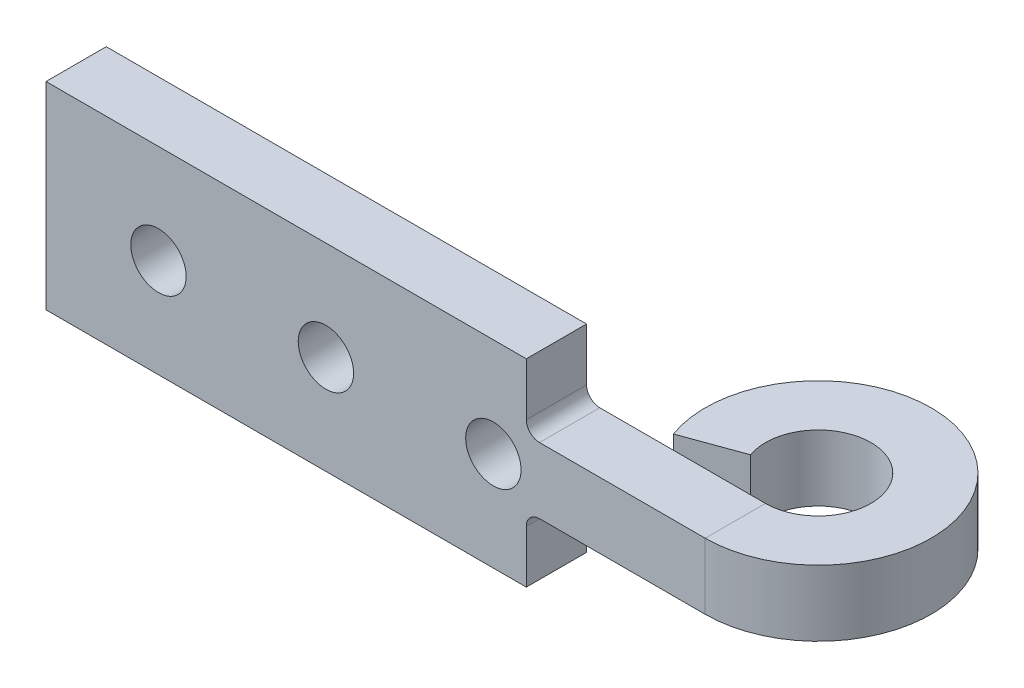
ISO-10303-21;
HEADER;
FILE_DESCRIPTION(('STEP AP214'),'2;1');
FILE_NAME('part.step','',(''),(''),'','','');
FILE_SCHEMA(('AUTOMOTIVE_DESIGN { 1 0 10303 214 1 1 1 1 }'));
ENDSEC;
DATA;
#1=APPLICATION_CONTEXT('core data for automotive mechanical design processes');
#2=APPLICATION_PROTOCOL_DEFINITION('international standard','automotive_design',2000,#1);
#3=PRODUCT_CONTEXT('',#1,'mechanical');
#4=PRODUCT('Part','Part','',(#3));
#5=PRODUCT_RELATED_PRODUCT_CATEGORY('part','',(#4));
#6=PRODUCT_DEFINITION_FORMATION('','',#4);
#7=PRODUCT_DEFINITION_CONTEXT('part definition',#1,'design');
#8=PRODUCT_DEFINITION('design','',#6,#7);
#9=PRODUCT_DEFINITION_SHAPE('','',#8);
#10=(LENGTH_UNIT() NAMED_UNIT(*) SI_UNIT(.MILLI.,.METRE.));
#11=(NAMED_UNIT(*) PLANE_ANGLE_UNIT() SI_UNIT($,.RADIAN.));
#12=(NAMED_UNIT(*) SI_UNIT($,.STERADIAN.) SOLID_ANGLE_UNIT());
#13=UNCERTAINTY_MEASURE_WITH_UNIT(LENGTH_MEASURE(1.E-05),#10,'distance_accuracy_value','');
#14=(GEOMETRIC_REPRESENTATION_CONTEXT(3) GLOBAL_UNCERTAINTY_ASSIGNED_CONTEXT((#13)) GLOBAL_UNIT_ASSIGNED_CONTEXT((#10,
#11,#12)) REPRESENTATION_CONTEXT('',''));
#15=CARTESIAN_POINT('',(0.,0.,0.));
#16=DIRECTION('',(0.,0.,1.));
#17=DIRECTION('',(1.,0.,0.));
#18=AXIS2_PLACEMENT_3D('',#15,#16,#17);
#19=CARTESIAN_POINT('',(58.57,10.,-14.));
#20=DIRECTION('',(0.,1.,0.));
#21=DIRECTION('',(0.,0.,1.));
#22=AXIS2_PLACEMENT_3D('',#19,#20,#21);
#23=PLANE('',#22);
#24=DIRECTION('',(1.,0.,0.));
#25=VECTOR('',#24,1.);
#26=CARTESIAN_POINT('',(0.,10.,0.));
#27=LINE('',#26,#25);
#28=CARTESIAN_POINT('',(37.43,10.,0.));
#29=VERTEX_POINT('',#28);
#30=CARTESIAN_POINT('',(50.,10.,0.));
#31=VERTEX_POINT('',#30);
#32=EDGE_CURVE('E161',#29,#31,#27,.T.);
#33=ORIENTED_EDGE('',*,*,#32,.F.);
#34=DIRECTION('',(0.,0.,1.));
#35=VECTOR('',#34,1.);
#36=CARTESIAN_POINT('',(37.43,10.,4.57));
#37=LINE('',#36,#35);
#38=CARTESIAN_POINT('',(37.43,10.,4.57));
#39=VERTEX_POINT('',#38);
#40=EDGE_CURVE('E199',#29,#39,#37,.T.);
#41=ORIENTED_EDGE('',*,*,#40,.T.);
#42=DIRECTION('',(1.,0.,0.));
#43=VECTOR('',#42,1.);
#44=CARTESIAN_POINT('',(0.,10.,4.57));
#45=LINE('',#44,#43);
#46=CARTESIAN_POINT('',(50.,10.,4.57));
#47=VERTEX_POINT('',#46);
#48=EDGE_CURVE('E192',#39,#47,#45,.T.);
#49=ORIENTED_EDGE('',*,*,#48,.T.);
#50=DIRECTION('',(0.,0.,-1.));
#51=VECTOR('',#50,1.);
#52=CARTESIAN_POINT('',(50.,10.,4.57));
#53=LINE('',#52,#51);
#54=EDGE_CURVE('E196',#47,#31,#53,.T.);
#55=ORIENTED_EDGE('',*,*,#54,.T.);
#56=EDGE_LOOP('',(#33,#41,#49,#55));
#57=FACE_BOUND('',#56,.T.);
#58=ADVANCED_FACE('F46',(#57),#23,.T.);
#59=CARTESIAN_POINT('',(58.57,5.,-14.));
#60=DIRECTION('',(0.,-1.,0.));
#61=DIRECTION('',(0.,0.,-1.));
#62=AXIS2_PLACEMENT_3D('',#59,#60,#61);
#63=PLANE('',#62);
#64=DIRECTION('',(-1.,0.,0.));
#65=VECTOR('',#64,1.);
#66=CARTESIAN_POINT('',(0.,5.,4.57));
#67=LINE('',#66,#65);
#68=CARTESIAN_POINT('',(50.,5.,4.57));
#69=VERTEX_POINT('',#68);
#70=CARTESIAN_POINT('',(37.43,5.,4.57));
#71=VERTEX_POINT('',#70);
#72=EDGE_CURVE('E190',#69,#71,#67,.T.);
#73=ORIENTED_EDGE('',*,*,#72,.T.);
#74=DIRECTION('',(0.,0.,1.));
#75=VECTOR('',#74,1.);
#76=CARTESIAN_POINT('',(37.43,5.,0.));
#77=LINE('',#76,#75);
#78=CARTESIAN_POINT('',(37.43,5.,0.));
#79=VERTEX_POINT('',#78);
#80=EDGE_CURVE('E67',#71,#79,#77,.F.);
#81=ORIENTED_EDGE('',*,*,#80,.T.);
#82=DIRECTION('',(-1.,0.,0.));
#83=VECTOR('',#82,1.);
#84=CARTESIAN_POINT('',(0.,5.,0.));
#85=LINE('',#84,#83);
#86=CARTESIAN_POINT('',(50.,5.,0.));
#87=VERTEX_POINT('',#86);
#88=EDGE_CURVE('E253',#87,#79,#85,.T.);
#89=ORIENTED_EDGE('',*,*,#88,.F.);
#90=DIRECTION('',(0.,0.,1.));
#91=VECTOR('',#90,1.);
#92=CARTESIAN_POINT('',(50.,5.,0.));
#93=LINE('',#92,#91);
#94=EDGE_CURVE('E194',#87,#69,#93,.T.);
#95=ORIENTED_EDGE('',*,*,#94,.T.);
#96=EDGE_LOOP('',(#73,#81,#89,#95));
#97=FACE_BOUND('',#96,.T.);
#98=ADVANCED_FACE('F279',(#97),#63,.T.);
#99=CARTESIAN_POINT('',(50.,15.,-4.));
#100=DIRECTION('',(0.,-1.,0.));
#101=DIRECTION('',(0.,0.,-1.));
#102=AXIS2_PLACEMENT_3D('',#99,#100,#101);
#103=CYLINDRICAL_SURFACE('',#102,8.57);
#104=DIRECTION('',(0.,-1.,0.));
#105=VECTOR('',#104,1.);
#106=CARTESIAN_POINT('',(41.9468342398648,15.,-1.06888737169904));
#107=LINE('',#106,#105);
#108=CARTESIAN_POINT('',(41.9468342398648,10.,-1.06888737169904));
#109=VERTEX_POINT('',#108);
#110=CARTESIAN_POINT('',(41.9468342398648,5.,-1.06888737169904));
#111=VERTEX_POINT('',#110);
#112=EDGE_CURVE('E156',#109,#111,#107,.T.);
#113=ORIENTED_EDGE('',*,*,#112,.F.);
#114=CARTESIAN_POINT('',(50.,10.,-4.));
#115=DIRECTION('',(0.,1.,0.));
#116=DIRECTION('',(0.,0.,1.));
#117=AXIS2_PLACEMENT_3D('',#114,#115,#116);
#118=CIRCLE('',#117,8.57);
#119=EDGE_CURVE('E255',#47,#109,#118,.T.);
#120=ORIENTED_EDGE('',*,*,#119,.F.);
#121=DIRECTION('',(0.,-1.,0.));
#122=VECTOR('',#121,1.);
#123=CARTESIAN_POINT('',(50.,15.,4.57));
#124=LINE('',#123,#122);
#125=EDGE_CURVE('E173',#47,#69,#124,.T.);
#126=ORIENTED_EDGE('',*,*,#125,.T.);
#127=CARTESIAN_POINT('',(50.,5.,-4.));
#128=DIRECTION('',(0.,-1.,0.));
#129=DIRECTION('',(0.,0.,-1.));
#130=AXIS2_PLACEMENT_3D('',#127,#128,#129);
#131=CIRCLE('',#130,8.57);
#132=EDGE_CURVE('E241',#111,#69,#131,.T.);
#133=ORIENTED_EDGE('',*,*,#132,.F.);
#134=EDGE_LOOP('',(#113,#120,#126,#133));
#135=FACE_BOUND('',#134,.T.);
#136=ADVANCED_FACE('F291',(#135),#103,.T.);
#137=CARTESIAN_POINT('',(46.2412295168564,15.,-2.63191942669733));
#138=DIRECTION('',(0.342020143325666,0.,0.93969262078591));
#139=DIRECTION('',(0.93969262078591,0.,-0.342020143325666));
#140=AXIS2_PLACEMENT_3D('',#137,#138,#139);
#141=PLANE('',#140);
#142=DIRECTION('',(0.,-1.,0.));
#143=VECTOR('',#142,1.);
#144=CARTESIAN_POINT('',(46.2412295168564,15.,-2.63191942669733));
#145=LINE('',#144,#143);
#146=CARTESIAN_POINT('',(46.2412295168564,10.,-2.63191942669733));
#147=VERTEX_POINT('',#146);
#148=CARTESIAN_POINT('',(46.2412295168564,5.,-2.63191942669733));
#149=VERTEX_POINT('',#148);
#150=EDGE_CURVE('E183',#147,#149,#145,.T.);
#151=ORIENTED_EDGE('',*,*,#150,.F.);
#152=DIRECTION('',(-0.93969262078591,0.,0.342020143325666));
#153=VECTOR('',#152,1.);
#154=CARTESIAN_POINT('',(46.2412295168564,10.,-2.63191942669733));
#155=LINE('',#154,#153);
#156=EDGE_CURVE('E257',#147,#109,#155,.T.);
#157=ORIENTED_EDGE('',*,*,#156,.T.);
#158=ORIENTED_EDGE('',*,*,#112,.T.);
#159=DIRECTION('',(0.93969262078591,0.,-0.342020143325666));
#160=VECTOR('',#159,1.);
#161=CARTESIAN_POINT('',(46.2412295168564,5.,-2.63191942669733));
#162=LINE('',#161,#160);
#163=EDGE_CURVE('E247',#111,#149,#162,.T.);
#164=ORIENTED_EDGE('',*,*,#163,.T.);
#165=EDGE_LOOP('',(#151,#157,#158,#164));
#166=FACE_BOUND('',#165,.T.);
#167=ADVANCED_FACE('F357',(#166),#141,.T.);
#168=CARTESIAN_POINT('',(50.,15.,-4.));
#169=DIRECTION('',(0.,-1.,0.));
#170=DIRECTION('',(0.,0.,-1.));
#171=AXIS2_PLACEMENT_3D('',#168,#169,#170);
#172=CYLINDRICAL_SURFACE('',#171,4.);
#173=DIRECTION('',(0.,-1.,0.));
#174=VECTOR('',#173,1.);
#175=CARTESIAN_POINT('',(50.,15.,0.));
#176=LINE('',#175,#174);
#177=EDGE_CURVE('E180',#31,#87,#176,.T.);
#178=ORIENTED_EDGE('',*,*,#177,.F.);
#179=CARTESIAN_POINT('',(50.,10.,-4.));
#180=DIRECTION('',(0.,1.,0.));
#181=DIRECTION('',(0.,0.,1.));
#182=AXIS2_PLACEMENT_3D('',#179,#180,#181);
#183=CIRCLE('',#182,4.);
#184=EDGE_CURVE('E165',#31,#147,#183,.T.);
#185=ORIENTED_EDGE('',*,*,#184,.T.);
#186=ORIENTED_EDGE('',*,*,#150,.T.);
#187=CARTESIAN_POINT('',(50.,5.,-4.));
#188=DIRECTION('',(0.,-1.,0.));
#189=DIRECTION('',(0.,0.,-1.));
#190=AXIS2_PLACEMENT_3D('',#187,#188,#189);
#191=CIRCLE('',#190,4.);
#192=EDGE_CURVE('E250',#149,#87,#191,.T.);
#193=ORIENTED_EDGE('',*,*,#192,.T.);
#194=EDGE_LOOP('',(#178,#185,#186,#193));
#195=FACE_BOUND('',#194,.T.);
#196=ADVANCED_FACE('F323',(#195),#172,.F.);
#197=CARTESIAN_POINT('',(0.,15.,0.));
#198=DIRECTION('',(0.,0.,-1.));
#199=DIRECTION('',(-1.,0.,0.));
#200=AXIS2_PLACEMENT_3D('',#197,#198,#199);
#201=PLANE('',#200);
#202=CARTESIAN_POINT('',(8.53,7.5,0.));
#203=DIRECTION('',(0.,0.,-1.));
#204=DIRECTION('',(-1.,0.,0.));
#205=AXIS2_PLACEMENT_3D('',#202,#203,#204);
#206=CIRCLE('',#205,2.1);
#207=CARTESIAN_POINT('',(6.43000000000001,7.5,0.));
#208=VERTEX_POINT('',#207);
#209=EDGE_CURVE('E204',#208,#208,#206,.T.);
#210=ORIENTED_EDGE('',*,*,#209,.F.);
#211=EDGE_LOOP('',(#210));
#212=FACE_BOUND('',#211,.T.);
#213=CARTESIAN_POINT('',(21.23,7.5,0.));
#214=DIRECTION('',(0.,0.,-1.));
#215=DIRECTION('',(-1.,0.,0.));
#216=AXIS2_PLACEMENT_3D('',#213,#214,#215);
#217=CIRCLE('',#216,2.1);
#218=CARTESIAN_POINT('',(19.13,7.5,0.));
#219=VERTEX_POINT('',#218);
#220=EDGE_CURVE('E312',#219,#219,#217,.T.);
#221=ORIENTED_EDGE('',*,*,#220,.F.);
#222=EDGE_LOOP('',(#221));
#223=FACE_BOUND('',#222,.T.);
#224=CARTESIAN_POINT('',(33.93,7.5,0.));
#225=DIRECTION('',(0.,0.,-1.));
#226=DIRECTION('',(-1.,0.,0.));
#227=AXIS2_PLACEMENT_3D('',#224,#225,#226);
#228=CIRCLE('',#227,2.1);
#229=CARTESIAN_POINT('',(31.83,7.5,0.));
#230=VERTEX_POINT('',#229);
#231=EDGE_CURVE('E309',#230,#230,#228,.T.);
#232=ORIENTED_EDGE('',*,*,#231,.F.);
#233=EDGE_LOOP('',(#232));
#234=FACE_BOUND('',#233,.T.);
#235=DIRECTION('',(0.,-1.,0.));
#236=VECTOR('',#235,1.);
#237=CARTESIAN_POINT('',(36.43,15.,0.));
#238=LINE('',#237,#236);
#239=CARTESIAN_POINT('',(36.43,15.,0.));
#240=VERTEX_POINT('',#239);
#241=CARTESIAN_POINT('',(36.43,11.,0.));
#242=VERTEX_POINT('',#241);
#243=EDGE_CURVE('E223',#240,#242,#238,.T.);
#244=ORIENTED_EDGE('',*,*,#243,.T.);
#245=CARTESIAN_POINT('',(37.43,11.,0.));
#246=DIRECTION('',(0.,0.,-1.));
#247=DIRECTION('',(-1.,0.,0.));
#248=AXIS2_PLACEMENT_3D('',#245,#246,#247);
#249=CIRCLE('',#248,1.);
#250=EDGE_CURVE('E219',#242,#29,#249,.F.);
#251=ORIENTED_EDGE('',*,*,#250,.T.);
#252=ORIENTED_EDGE('',*,*,#32,.T.);
#253=ORIENTED_EDGE('',*,*,#177,.T.);
#254=ORIENTED_EDGE('',*,*,#88,.T.);
#255=CARTESIAN_POINT('',(37.43,4.,0.));
#256=DIRECTION('',(0.,0.,-1.));
#257=DIRECTION('',(-1.,0.,0.));
#258=AXIS2_PLACEMENT_3D('',#255,#256,#257);
#259=CIRCLE('',#258,1.);
#260=CARTESIAN_POINT('',(36.43,4.,0.));
#261=VERTEX_POINT('',#260);
#262=EDGE_CURVE('E12',#79,#261,#259,.F.);
#263=ORIENTED_EDGE('',*,*,#262,.T.);
#264=DIRECTION('',(0.,-1.,0.));
#265=VECTOR('',#264,1.);
#266=CARTESIAN_POINT('',(36.43,15.,0.));
#267=LINE('',#266,#265);
#268=CARTESIAN_POINT('',(36.43,0.,0.));
#269=VERTEX_POINT('',#268);
#270=EDGE_CURVE('E135',#261,#269,#267,.T.);
#271=ORIENTED_EDGE('',*,*,#270,.T.);
#272=DIRECTION('',(1.,0.,0.));
#273=VECTOR('',#272,1.);
#274=CARTESIAN_POINT('',(0.,0.,0.));
#275=LINE('',#274,#273);
#276=CARTESIAN_POINT('',(0.,0.,0.));
#277=VERTEX_POINT('',#276);
#278=EDGE_CURVE('E140',#277,#269,#275,.T.);
#279=ORIENTED_EDGE('',*,*,#278,.F.);
#280=DIRECTION('',(0.,-1.,0.));
#281=VECTOR('',#280,1.);
#282=CARTESIAN_POINT('',(0.,15.,0.));
#283=LINE('',#282,#281);
#284=CARTESIAN_POINT('',(0.,15.,0.));
#285=VERTEX_POINT('',#284);
#286=EDGE_CURVE('E178',#285,#277,#283,.T.);
#287=ORIENTED_EDGE('',*,*,#286,.F.);
#288=DIRECTION('',(1.,0.,0.));
#289=VECTOR('',#288,1.);
#290=CARTESIAN_POINT('',(0.,15.,0.));
#291=LINE('',#290,#289);
#292=EDGE_CURVE('E172',#285,#240,#291,.T.);
#293=ORIENTED_EDGE('',*,*,#292,.T.);
#294=EDGE_LOOP('',(#244,#251,#252,#253,#254,#263,#271,#279,#287,#293));
#295=FACE_BOUND('',#294,.T.);
#296=ADVANCED_FACE('F138',(#212,#223,#234,#295),#201,.T.);
#297=CARTESIAN_POINT('',(0.,15.,4.57));
#298=DIRECTION('',(0.,0.,-1.));
#299=DIRECTION('',(-1.,0.,0.));
#300=AXIS2_PLACEMENT_3D('',#297,#298,#299);
#301=PLANE('',#300);
#302=CARTESIAN_POINT('',(8.53,7.5,4.57));
#303=DIRECTION('',(0.,0.,-1.));
#304=DIRECTION('',(-1.,0.,0.));
#305=AXIS2_PLACEMENT_3D('',#302,#303,#304);
#306=CIRCLE('',#305,2.1);
#307=CARTESIAN_POINT('',(6.43000000000001,7.5,4.57));
#308=VERTEX_POINT('',#307);
#309=EDGE_CURVE('E207',#308,#308,#306,.T.);
#310=ORIENTED_EDGE('',*,*,#309,.T.);
#311=EDGE_LOOP('',(#310));
#312=FACE_BOUND('',#311,.T.);
#313=CARTESIAN_POINT('',(21.23,7.5,4.57));
#314=DIRECTION('',(0.,0.,-1.));
#315=DIRECTION('',(-1.,0.,0.));
#316=AXIS2_PLACEMENT_3D('',#313,#314,#315);
#317=CIRCLE('',#316,2.1);
#318=CARTESIAN_POINT('',(19.13,7.5,4.57));
#319=VERTEX_POINT('',#318);
#320=EDGE_CURVE('E203',#319,#319,#317,.T.);
#321=ORIENTED_EDGE('',*,*,#320,.T.);
#322=EDGE_LOOP('',(#321));
#323=FACE_BOUND('',#322,.T.);
#324=CARTESIAN_POINT('',(33.93,7.5,4.57));
#325=DIRECTION('',(0.,0.,-1.));
#326=DIRECTION('',(-1.,0.,0.));
#327=AXIS2_PLACEMENT_3D('',#324,#325,#326);
#328=CIRCLE('',#327,2.1);
#329=CARTESIAN_POINT('',(31.83,7.5,4.57));
#330=VERTEX_POINT('',#329);
#331=EDGE_CURVE('E200',#330,#330,#328,.T.);
#332=ORIENTED_EDGE('',*,*,#331,.T.);
#333=EDGE_LOOP('',(#332));
#334=FACE_BOUND('',#333,.T.);
#335=ORIENTED_EDGE('',*,*,#48,.F.);
#336=CARTESIAN_POINT('',(37.43,11.,4.57));
#337=DIRECTION('',(0.,0.,-1.));
#338=DIRECTION('',(-1.,0.,0.));
#339=AXIS2_PLACEMENT_3D('',#336,#337,#338);
#340=CIRCLE('',#339,1.);
#341=CARTESIAN_POINT('',(36.43,11.,4.57));
#342=VERTEX_POINT('',#341);
#343=EDGE_CURVE('E217',#39,#342,#340,.T.);
#344=ORIENTED_EDGE('',*,*,#343,.T.);
#345=DIRECTION('',(0.,-1.,0.));
#346=VECTOR('',#345,1.);
#347=CARTESIAN_POINT('',(36.43,15.,4.57));
#348=LINE('',#347,#346);
#349=CARTESIAN_POINT('',(36.43,15.,4.57));
#350=VERTEX_POINT('',#349);
#351=EDGE_CURVE('E146',#350,#342,#348,.T.);
#352=ORIENTED_EDGE('',*,*,#351,.F.);
#353=DIRECTION('',(1.,0.,0.));
#354=VECTOR('',#353,1.);
#355=CARTESIAN_POINT('',(0.,15.,4.57));
#356=LINE('',#355,#354);
#357=CARTESIAN_POINT('',(0.,15.,4.57));
#358=VERTEX_POINT('',#357);
#359=EDGE_CURVE('E168',#358,#350,#356,.T.);
#360=ORIENTED_EDGE('',*,*,#359,.F.);
#361=DIRECTION('',(0.,-1.,0.));
#362=VECTOR('',#361,1.);
#363=CARTESIAN_POINT('',(0.,15.,4.57));
#364=LINE('',#363,#362);
#365=CARTESIAN_POINT('',(0.,0.,4.57));
#366=VERTEX_POINT('',#365);
#367=EDGE_CURVE('E176',#358,#366,#364,.T.);
#368=ORIENTED_EDGE('',*,*,#367,.T.);
#369=DIRECTION('',(1.,0.,0.));
#370=VECTOR('',#369,1.);
#371=CARTESIAN_POINT('',(0.,0.,4.57));
#372=LINE('',#371,#370);
#373=CARTESIAN_POINT('',(36.43,0.,4.57));
#374=VERTEX_POINT('',#373);
#375=EDGE_CURVE('E163',#366,#374,#372,.T.);
#376=ORIENTED_EDGE('',*,*,#375,.T.);
#377=DIRECTION('',(0.,-1.,0.));
#378=VECTOR('',#377,1.);
#379=CARTESIAN_POINT('',(36.43,15.,4.57));
#380=LINE('',#379,#378);
#381=CARTESIAN_POINT('',(36.43,4.,4.57));
#382=VERTEX_POINT('',#381);
#383=EDGE_CURVE('E147',#382,#374,#380,.T.);
#384=ORIENTED_EDGE('',*,*,#383,.F.);
#385=CARTESIAN_POINT('',(37.43,4.,4.57));
#386=DIRECTION('',(0.,0.,-1.));
#387=DIRECTION('',(-1.,0.,0.));
#388=AXIS2_PLACEMENT_3D('',#385,#386,#387);
#389=CIRCLE('',#388,1.);
#390=EDGE_CURVE('E54',#382,#71,#389,.T.);
#391=ORIENTED_EDGE('',*,*,#390,.T.);
#392=ORIENTED_EDGE('',*,*,#72,.F.);
#393=ORIENTED_EDGE('',*,*,#125,.F.);
#394=EDGE_LOOP('',(#335,#344,#352,#360,#368,#376,#384,#391,#392,#393));
#395=FACE_BOUND('',#394,.T.);
#396=ADVANCED_FACE('F234',(#312,#323,#334,#395),#301,.F.);
#397=CARTESIAN_POINT('',(50.,15.,-4.));
#398=DIRECTION('',(0.,1.,0.));
#399=DIRECTION('',(1.,0.,0.));
#400=AXIS2_PLACEMENT_3D('',#397,#398,#399);
#401=PLANE('',#400);
#402=ORIENTED_EDGE('',*,*,#359,.T.);
#403=DIRECTION('',(0.,0.,-1.));
#404=VECTOR('',#403,1.);
#405=CARTESIAN_POINT('',(36.43,15.,-4.));
#406=LINE('',#405,#404);
#407=EDGE_CURVE('E155',#350,#240,#406,.T.);
#408=ORIENTED_EDGE('',*,*,#407,.T.);
#409=ORIENTED_EDGE('',*,*,#292,.F.);
#410=DIRECTION('',(0.,0.,-1.));
#411=VECTOR('',#410,1.);
#412=CARTESIAN_POINT('',(0.,15.,4.57));
#413=LINE('',#412,#411);
#414=EDGE_CURVE('E262',#358,#285,#413,.T.);
#415=ORIENTED_EDGE('',*,*,#414,.F.);
#416=EDGE_LOOP('',(#402,#408,#409,#415));
#417=FACE_BOUND('',#416,.T.);
#418=ADVANCED_FACE('F267',(#417),#401,.T.);
#419=CARTESIAN_POINT('',(50.,0.,-4.));
#420=DIRECTION('',(0.,1.,0.));
#421=DIRECTION('',(1.,0.,0.));
#422=AXIS2_PLACEMENT_3D('',#419,#420,#421);
#423=PLANE('',#422);
#424=DIRECTION('',(0.,0.,-1.));
#425=VECTOR('',#424,1.);
#426=CARTESIAN_POINT('',(36.43,0.,-4.));
#427=LINE('',#426,#425);
#428=EDGE_CURVE('E150',#374,#269,#427,.T.);
#429=ORIENTED_EDGE('',*,*,#428,.F.);
#430=ORIENTED_EDGE('',*,*,#375,.F.);
#431=DIRECTION('',(0.,0.,-1.));
#432=VECTOR('',#431,1.);
#433=CARTESIAN_POINT('',(0.,0.,4.57));
#434=LINE('',#433,#432);
#435=EDGE_CURVE('E160',#366,#277,#434,.T.);
#436=ORIENTED_EDGE('',*,*,#435,.T.);
#437=ORIENTED_EDGE('',*,*,#278,.T.);
#438=EDGE_LOOP('',(#429,#430,#436,#437));
#439=FACE_BOUND('',#438,.T.);
#440=ADVANCED_FACE('F158',(#439),#423,.F.);
#441=CARTESIAN_POINT('',(0.,15.,4.57));
#442=DIRECTION('',(-1.,0.,0.));
#443=DIRECTION('',(0.,0.,1.));
#444=AXIS2_PLACEMENT_3D('',#441,#442,#443);
#445=PLANE('',#444);
#446=ORIENTED_EDGE('',*,*,#435,.F.);
#447=ORIENTED_EDGE('',*,*,#367,.F.);
#448=ORIENTED_EDGE('',*,*,#414,.T.);
#449=ORIENTED_EDGE('',*,*,#286,.T.);
#450=EDGE_LOOP('',(#446,#447,#448,#449));
#451=FACE_BOUND('',#450,.T.);
#452=ADVANCED_FACE('F269',(#451),#445,.T.);
#453=ORIENTED_EDGE('',*,*,#94,.F.);
#454=ORIENTED_EDGE('',*,*,#192,.F.);
#455=ORIENTED_EDGE('',*,*,#163,.F.);
#456=ORIENTED_EDGE('',*,*,#132,.T.);
#457=EDGE_LOOP('',(#453,#454,#455,#456));
#458=FACE_BOUND('',#457,.T.);
#459=ADVANCED_FACE('F271',(#458),#63,.T.);
#460=CARTESIAN_POINT('',(36.43,5.,-14.));
#461=DIRECTION('',(1.,0.,0.));
#462=DIRECTION('',(0.,0.,-1.));
#463=AXIS2_PLACEMENT_3D('',#460,#461,#462);
#464=PLANE('',#463);
#465=ORIENTED_EDGE('',*,*,#270,.F.);
#466=DIRECTION('',(0.,0.,1.));
#467=VECTOR('',#466,1.);
#468=CARTESIAN_POINT('',(36.43,4.,4.57));
#469=LINE('',#468,#467);
#470=EDGE_CURVE('E214',#261,#382,#469,.T.);
#471=ORIENTED_EDGE('',*,*,#470,.T.);
#472=ORIENTED_EDGE('',*,*,#383,.T.);
#473=ORIENTED_EDGE('',*,*,#428,.T.);
#474=EDGE_LOOP('',(#465,#471,#472,#473));
#475=FACE_BOUND('',#474,.T.);
#476=ADVANCED_FACE('F151',(#475),#464,.T.);
#477=ORIENTED_EDGE('',*,*,#54,.F.);
#478=ORIENTED_EDGE('',*,*,#119,.T.);
#479=ORIENTED_EDGE('',*,*,#156,.F.);
#480=ORIENTED_EDGE('',*,*,#184,.F.);
#481=EDGE_LOOP('',(#477,#478,#479,#480));
#482=FACE_BOUND('',#481,.T.);
#483=ADVANCED_FACE('F286',(#482),#23,.T.);
#484=CARTESIAN_POINT('',(36.43,15.,-14.));
#485=DIRECTION('',(1.,0.,0.));
#486=DIRECTION('',(0.,0.,-1.));
#487=AXIS2_PLACEMENT_3D('',#484,#485,#486);
#488=PLANE('',#487);
#489=ORIENTED_EDGE('',*,*,#351,.T.);
#490=DIRECTION('',(0.,0.,1.));
#491=VECTOR('',#490,1.);
#492=CARTESIAN_POINT('',(36.43,11.,0.));
#493=LINE('',#492,#491);
#494=EDGE_CURVE('E212',#342,#242,#493,.F.);
#495=ORIENTED_EDGE('',*,*,#494,.T.);
#496=ORIENTED_EDGE('',*,*,#243,.F.);
#497=ORIENTED_EDGE('',*,*,#407,.F.);
#498=EDGE_LOOP('',(#489,#495,#496,#497));
#499=FACE_BOUND('',#498,.T.);
#500=ADVANCED_FACE('F239',(#499),#488,.T.);
#501=CARTESIAN_POINT('',(33.93,7.5,10.));
#502=DIRECTION('',(0.,0.,-1.));
#503=DIRECTION('',(-1.,0.,0.));
#504=AXIS2_PLACEMENT_3D('',#501,#502,#503);
#505=CYLINDRICAL_SURFACE('',#504,2.1);
#506=ORIENTED_EDGE('',*,*,#231,.T.);
#507=EDGE_LOOP('',(#506));
#508=FACE_BOUND('',#507,.T.);
#509=ORIENTED_EDGE('',*,*,#331,.F.);
#510=EDGE_LOOP('',(#509));
#511=FACE_BOUND('',#510,.T.);
#512=ADVANCED_FACE('F300',(#508,#511),#505,.F.);
#513=CARTESIAN_POINT('',(21.23,7.5,10.));
#514=DIRECTION('',(0.,0.,-1.));
#515=DIRECTION('',(-1.,0.,0.));
#516=AXIS2_PLACEMENT_3D('',#513,#514,#515);
#517=CYLINDRICAL_SURFACE('',#516,2.1);
#518=ORIENTED_EDGE('',*,*,#220,.T.);
#519=EDGE_LOOP('',(#518));
#520=FACE_BOUND('',#519,.T.);
#521=ORIENTED_EDGE('',*,*,#320,.F.);
#522=EDGE_LOOP('',(#521));
#523=FACE_BOUND('',#522,.T.);
#524=ADVANCED_FACE('F329',(#520,#523),#517,.F.);
#525=CARTESIAN_POINT('',(8.53,7.5,10.));
#526=DIRECTION('',(0.,0.,-1.));
#527=DIRECTION('',(-1.,0.,0.));
#528=AXIS2_PLACEMENT_3D('',#525,#526,#527);
#529=CYLINDRICAL_SURFACE('',#528,2.1);
#530=ORIENTED_EDGE('',*,*,#209,.T.);
#531=EDGE_LOOP('',(#530));
#532=FACE_BOUND('',#531,.T.);
#533=ORIENTED_EDGE('',*,*,#309,.F.);
#534=EDGE_LOOP('',(#533));
#535=FACE_BOUND('',#534,.T.);
#536=ADVANCED_FACE('F318',(#532,#535),#529,.F.);
#537=CARTESIAN_POINT('',(37.43,11.,-14.));
#538=DIRECTION('',(0.,0.,-1.));
#539=DIRECTION('',(-1.,0.,0.));
#540=AXIS2_PLACEMENT_3D('',#537,#538,#539);
#541=CYLINDRICAL_SURFACE('',#540,1.);
#542=ORIENTED_EDGE('',*,*,#250,.F.);
#543=ORIENTED_EDGE('',*,*,#494,.F.);
#544=ORIENTED_EDGE('',*,*,#343,.F.);
#545=ORIENTED_EDGE('',*,*,#40,.F.);
#546=EDGE_LOOP('',(#542,#543,#544,#545));
#547=FACE_BOUND('',#546,.T.);
#548=ADVANCED_FACE('F231',(#547),#541,.F.);
#549=CARTESIAN_POINT('',(37.43,4.,-14.));
#550=DIRECTION('',(0.,0.,-1.));
#551=DIRECTION('',(-1.,0.,0.));
#552=AXIS2_PLACEMENT_3D('',#549,#550,#551);
#553=CYLINDRICAL_SURFACE('',#552,1.);
#554=ORIENTED_EDGE('',*,*,#262,.F.);
#555=ORIENTED_EDGE('',*,*,#80,.F.);
#556=ORIENTED_EDGE('',*,*,#390,.F.);
#557=ORIENTED_EDGE('',*,*,#470,.F.);
#558=EDGE_LOOP('',(#554,#555,#556,#557));
#559=FACE_BOUND('',#558,.T.);
#560=ADVANCED_FACE('F48',(#559),#553,.F.);
#561=CLOSED_SHELL('',(#58,#98,#136,#167,#196,#296,#396,#418,#440,#452,#459,#476,#483,#500,#512,
#524,#536,#548,#560));
#562=MANIFOLD_SOLID_BREP('B2',#561);
#563=ADVANCED_BREP_SHAPE_REPRESENTATION('',(#18,#562),#14);
#564=SHAPE_DEFINITION_REPRESENTATION(#9,#563);
ENDSEC;
END-ISO-10303-21;
